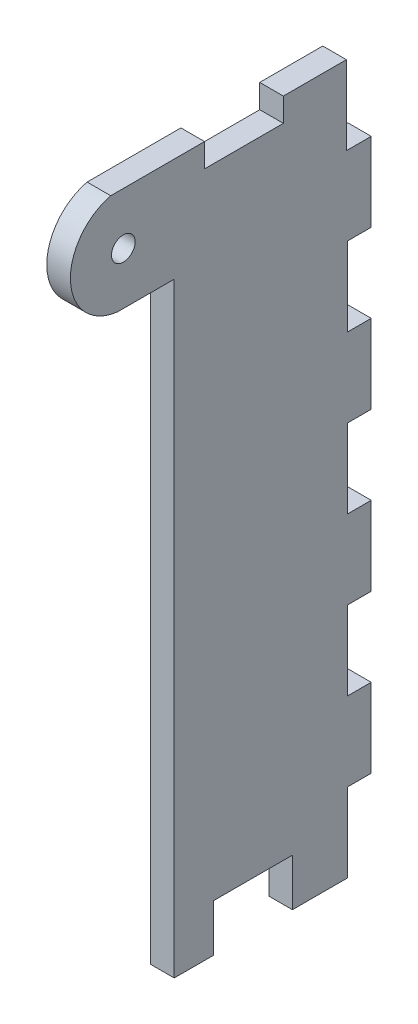
ISO-10303-21;
HEADER;
FILE_DESCRIPTION(('STEP AP214'),'2;1');
FILE_NAME('part.step','',(''),(''),'','','');
FILE_SCHEMA(('AUTOMOTIVE_DESIGN { 1 0 10303 214 1 1 1 1 }'));
ENDSEC;
DATA;
#1=APPLICATION_CONTEXT('core data for automotive mechanical design processes');
#2=APPLICATION_PROTOCOL_DEFINITION('international standard','automotive_design',2000,#1);
#3=PRODUCT_CONTEXT('',#1,'mechanical');
#4=PRODUCT('Part','Part','',(#3));
#5=PRODUCT_RELATED_PRODUCT_CATEGORY('part','',(#4));
#6=PRODUCT_DEFINITION_FORMATION('','',#4);
#7=PRODUCT_DEFINITION_CONTEXT('part definition',#1,'design');
#8=PRODUCT_DEFINITION('design','',#6,#7);
#9=PRODUCT_DEFINITION_SHAPE('','',#8);
#10=(LENGTH_UNIT() NAMED_UNIT(*) SI_UNIT(.MILLI.,.METRE.));
#11=(NAMED_UNIT(*) PLANE_ANGLE_UNIT() SI_UNIT($,.RADIAN.));
#12=(NAMED_UNIT(*) SI_UNIT($,.STERADIAN.) SOLID_ANGLE_UNIT());
#13=UNCERTAINTY_MEASURE_WITH_UNIT(LENGTH_MEASURE(1.E-05),#10,'distance_accuracy_value','');
#14=(GEOMETRIC_REPRESENTATION_CONTEXT(3) GLOBAL_UNCERTAINTY_ASSIGNED_CONTEXT((#13)) GLOBAL_UNIT_ASSIGNED_CONTEXT((#10,
#11,#12)) REPRESENTATION_CONTEXT('',''));
#15=CARTESIAN_POINT('',(0.,0.,0.));
#16=DIRECTION('',(0.,0.,1.));
#17=DIRECTION('',(1.,0.,0.));
#18=AXIS2_PLACEMENT_3D('',#15,#16,#17);
#19=CARTESIAN_POINT('',(3.,89.1714822270664,7.78017889808236));
#20=DIRECTION('',(1.,0.,0.));
#21=DIRECTION('',(0.,0.,-1.));
#22=AXIS2_PLACEMENT_3D('',#19,#20,#21);
#23=PLANE('',#22);
#24=DIRECTION('',(0.,-1.,0.));
#25=VECTOR('',#24,1.);
#26=CARTESIAN_POINT('',(3.,5.69298590310573,1.32442224705042));
#27=LINE('',#26,#25);
#28=CARTESIAN_POINT('',(3.,82.4929859031057,1.32442224705043));
#29=VERTEX_POINT('',#28);
#30=CARTESIAN_POINT('',(3.,5.69298590310573,1.32442224705042));
#31=VERTEX_POINT('',#30);
#32=EDGE_CURVE('E320',#29,#31,#27,.T.);
#33=ORIENTED_EDGE('',*,*,#32,.T.);
#34=DIRECTION('',(0.,0.,-1.));
#35=VECTOR('',#34,1.);
#36=CARTESIAN_POINT('',(3.,5.69298590310573,1.32442224705042));
#37=LINE('',#36,#35);
#38=CARTESIAN_POINT('',(3.,5.69298590310573,-3.67557775294958));
#39=VERTEX_POINT('',#38);
#40=EDGE_CURVE('E158',#31,#39,#37,.T.);
#41=ORIENTED_EDGE('',*,*,#40,.T.);
#42=DIRECTION('',(0.,1.,0.));
#43=VECTOR('',#42,1.);
#44=CARTESIAN_POINT('',(3.,11.6929859031057,-3.67557775294957));
#45=LINE('',#44,#43);
#46=CARTESIAN_POINT('',(3.,11.6929859031057,-3.67557775294957));
#47=VERTEX_POINT('',#46);
#48=EDGE_CURVE('E401',#39,#47,#45,.T.);
#49=ORIENTED_EDGE('',*,*,#48,.T.);
#50=DIRECTION('',(0.,0.,-1.));
#51=VECTOR('',#50,1.);
#52=CARTESIAN_POINT('',(3.,11.6929859031057,-3.67557775294957));
#53=LINE('',#52,#51);
#54=CARTESIAN_POINT('',(3.,11.6929859031057,-13.6755777529496));
#55=VERTEX_POINT('',#54);
#56=EDGE_CURVE('E420',#47,#55,#53,.T.);
#57=ORIENTED_EDGE('',*,*,#56,.T.);
#58=DIRECTION('',(0.,-1.,0.));
#59=VECTOR('',#58,1.);
#60=CARTESIAN_POINT('',(3.,11.6929859031057,-13.6755777529496));
#61=LINE('',#60,#59);
#62=CARTESIAN_POINT('',(3.,5.69298590310573,-13.6755777529496));
#63=VERTEX_POINT('',#62);
#64=EDGE_CURVE('E417',#55,#63,#61,.T.);
#65=ORIENTED_EDGE('',*,*,#64,.T.);
#66=DIRECTION('',(0.,0.,-1.));
#67=VECTOR('',#66,1.);
#68=CARTESIAN_POINT('',(3.,5.69298590310573,-13.6755777529496));
#69=LINE('',#68,#67);
#70=CARTESIAN_POINT('',(3.,5.69298590310573,-20.6755777529496));
#71=VERTEX_POINT('',#70);
#72=EDGE_CURVE('E419',#63,#71,#69,.T.);
#73=ORIENTED_EDGE('',*,*,#72,.T.);
#74=DIRECTION('',(0.,1.,0.));
#75=VECTOR('',#74,1.);
#76=CARTESIAN_POINT('',(3.,15.6929859031058,-20.6755777529496));
#77=LINE('',#76,#75);
#78=CARTESIAN_POINT('',(3.,15.6929859031058,-20.6755777529496));
#79=VERTEX_POINT('',#78);
#80=EDGE_CURVE('E422',#71,#79,#77,.T.);
#81=ORIENTED_EDGE('',*,*,#80,.T.);
#82=DIRECTION('',(0.,0.,-1.));
#83=VECTOR('',#82,1.);
#84=CARTESIAN_POINT('',(3.,15.6929859031058,-20.6755777529496));
#85=LINE('',#84,#83);
#86=CARTESIAN_POINT('',(3.,15.6929859031058,-23.6755777529496));
#87=VERTEX_POINT('',#86);
#88=EDGE_CURVE('E428',#79,#87,#85,.T.);
#89=ORIENTED_EDGE('',*,*,#88,.T.);
#90=DIRECTION('',(0.,1.,0.));
#91=VECTOR('',#90,1.);
#92=CARTESIAN_POINT('',(3.,15.6929859031058,-23.6755777529496));
#93=LINE('',#92,#91);
#94=CARTESIAN_POINT('',(3.,25.6929859031057,-23.6755777529496));
#95=VERTEX_POINT('',#94);
#96=EDGE_CURVE('E430',#87,#95,#93,.T.);
#97=ORIENTED_EDGE('',*,*,#96,.T.);
#98=DIRECTION('',(0.,0.,1.));
#99=VECTOR('',#98,1.);
#100=CARTESIAN_POINT('',(3.,25.6929859031058,-20.6755777529495));
#101=LINE('',#100,#99);
#102=CARTESIAN_POINT('',(3.,25.6929859031058,-20.6755777529495));
#103=VERTEX_POINT('',#102);
#104=EDGE_CURVE('E432',#95,#103,#101,.T.);
#105=ORIENTED_EDGE('',*,*,#104,.T.);
#106=DIRECTION('',(0.,1.,0.));
#107=VECTOR('',#106,1.);
#108=CARTESIAN_POINT('',(3.,35.6929859031058,-20.6755777529495));
#109=LINE('',#108,#107);
#110=CARTESIAN_POINT('',(3.,35.6929859031058,-20.6755777529495));
#111=VERTEX_POINT('',#110);
#112=EDGE_CURVE('E434',#103,#111,#109,.T.);
#113=ORIENTED_EDGE('',*,*,#112,.T.);
#114=DIRECTION('',(0.,0.,-1.));
#115=VECTOR('',#114,1.);
#116=CARTESIAN_POINT('',(3.,35.6929859031058,-20.6755777529495));
#117=LINE('',#116,#115);
#118=CARTESIAN_POINT('',(3.,35.6929859031058,-23.6755777529496));
#119=VERTEX_POINT('',#118);
#120=EDGE_CURVE('E436',#111,#119,#117,.T.);
#121=ORIENTED_EDGE('',*,*,#120,.T.);
#122=DIRECTION('',(0.,1.,0.));
#123=VECTOR('',#122,1.);
#124=CARTESIAN_POINT('',(3.,35.6929859031058,-23.6755777529496));
#125=LINE('',#124,#123);
#126=CARTESIAN_POINT('',(3.,45.6929859031058,-23.6755777529496));
#127=VERTEX_POINT('',#126);
#128=EDGE_CURVE('E438',#119,#127,#125,.T.);
#129=ORIENTED_EDGE('',*,*,#128,.T.);
#130=DIRECTION('',(0.,0.,1.));
#131=VECTOR('',#130,1.);
#132=CARTESIAN_POINT('',(3.,45.6929859031058,-20.6755777529495));
#133=LINE('',#132,#131);
#134=CARTESIAN_POINT('',(3.,45.6929859031058,-20.6755777529495));
#135=VERTEX_POINT('',#134);
#136=EDGE_CURVE('E440',#127,#135,#133,.T.);
#137=ORIENTED_EDGE('',*,*,#136,.T.);
#138=DIRECTION('',(0.,1.,0.));
#139=VECTOR('',#138,1.);
#140=CARTESIAN_POINT('',(3.,55.6929859031058,-20.6755777529495));
#141=LINE('',#140,#139);
#142=CARTESIAN_POINT('',(3.,55.6929859031058,-20.6755777529495));
#143=VERTEX_POINT('',#142);
#144=EDGE_CURVE('E442',#135,#143,#141,.T.);
#145=ORIENTED_EDGE('',*,*,#144,.T.);
#146=DIRECTION('',(0.,0.,-1.));
#147=VECTOR('',#146,1.);
#148=CARTESIAN_POINT('',(3.,55.6929859031058,-20.6755777529495));
#149=LINE('',#148,#147);
#150=CARTESIAN_POINT('',(3.,55.6929859031058,-23.6755777529496));
#151=VERTEX_POINT('',#150);
#152=EDGE_CURVE('E444',#143,#151,#149,.T.);
#153=ORIENTED_EDGE('',*,*,#152,.T.);
#154=DIRECTION('',(0.,1.,0.));
#155=VECTOR('',#154,1.);
#156=CARTESIAN_POINT('',(3.,55.6929859031058,-23.6755777529496));
#157=LINE('',#156,#155);
#158=CARTESIAN_POINT('',(3.,65.6929859031058,-23.6755777529496));
#159=VERTEX_POINT('',#158);
#160=EDGE_CURVE('E446',#151,#159,#157,.T.);
#161=ORIENTED_EDGE('',*,*,#160,.T.);
#162=DIRECTION('',(0.,0.,1.));
#163=VECTOR('',#162,1.);
#164=CARTESIAN_POINT('',(3.,65.6929859031058,-20.6755777529495));
#165=LINE('',#164,#163);
#166=CARTESIAN_POINT('',(3.,65.6929859031058,-20.6755777529495));
#167=VERTEX_POINT('',#166);
#168=EDGE_CURVE('E448',#159,#167,#165,.T.);
#169=ORIENTED_EDGE('',*,*,#168,.T.);
#170=DIRECTION('',(0.,1.,0.));
#171=VECTOR('',#170,1.);
#172=CARTESIAN_POINT('',(3.,75.6929859031058,-20.6755777529495));
#173=LINE('',#172,#171);
#174=CARTESIAN_POINT('',(3.,75.6929859031058,-20.6755777529495));
#175=VERTEX_POINT('',#174);
#176=EDGE_CURVE('E450',#167,#175,#173,.T.);
#177=ORIENTED_EDGE('',*,*,#176,.T.);
#178=DIRECTION('',(0.,0.,-1.));
#179=VECTOR('',#178,1.);
#180=CARTESIAN_POINT('',(3.,75.6929859031058,-20.6755777529495));
#181=LINE('',#180,#179);
#182=CARTESIAN_POINT('',(3.,75.6929859031058,-23.6755777529496));
#183=VERTEX_POINT('',#182);
#184=EDGE_CURVE('E452',#175,#183,#181,.T.);
#185=ORIENTED_EDGE('',*,*,#184,.T.);
#186=DIRECTION('',(0.,1.,0.));
#187=VECTOR('',#186,1.);
#188=CARTESIAN_POINT('',(3.,75.6929859031058,-23.6755777529496));
#189=LINE('',#188,#187);
#190=CARTESIAN_POINT('',(3.,85.6929859031057,-23.6755777529496));
#191=VERTEX_POINT('',#190);
#192=EDGE_CURVE('E454',#183,#191,#189,.T.);
#193=ORIENTED_EDGE('',*,*,#192,.T.);
#194=DIRECTION('',(0.,0.,1.));
#195=VECTOR('',#194,1.);
#196=CARTESIAN_POINT('',(3.,85.6929859031057,-20.525652309048));
#197=LINE('',#196,#195);
#198=CARTESIAN_POINT('',(3.,85.6929859031057,-20.525652309048));
#199=VERTEX_POINT('',#198);
#200=EDGE_CURVE('E456',#191,#199,#197,.T.);
#201=ORIENTED_EDGE('',*,*,#200,.T.);
#202=DIRECTION('',(0.,1.,0.));
#203=VECTOR('',#202,1.);
#204=CARTESIAN_POINT('',(3.,95.6929859031057,-20.525652309048));
#205=LINE('',#204,#203);
#206=CARTESIAN_POINT('',(3.,95.6929859031057,-20.525652309048));
#207=VERTEX_POINT('',#206);
#208=EDGE_CURVE('E458',#199,#207,#205,.T.);
#209=ORIENTED_EDGE('',*,*,#208,.T.);
#210=DIRECTION('',(0.,0.,1.));
#211=VECTOR('',#210,1.);
#212=CARTESIAN_POINT('',(3.,95.6929859031057,-12.525652309048));
#213=LINE('',#212,#211);
#214=CARTESIAN_POINT('',(3.,95.6929859031057,-12.525652309048));
#215=VERTEX_POINT('',#214);
#216=EDGE_CURVE('E460',#207,#215,#213,.T.);
#217=ORIENTED_EDGE('',*,*,#216,.T.);
#218=DIRECTION('',(0.,-1.,0.));
#219=VECTOR('',#218,1.);
#220=CARTESIAN_POINT('',(3.,92.6929859031057,-12.525652309048));
#221=LINE('',#220,#219);
#222=CARTESIAN_POINT('',(3.,92.6929859031057,-12.525652309048));
#223=VERTEX_POINT('',#222);
#224=EDGE_CURVE('E462',#215,#223,#221,.T.);
#225=ORIENTED_EDGE('',*,*,#224,.T.);
#226=DIRECTION('',(0.,0.,1.));
#227=VECTOR('',#226,1.);
#228=CARTESIAN_POINT('',(3.,92.6929859031057,-12.525652309048));
#229=LINE('',#228,#227);
#230=CARTESIAN_POINT('',(3.,92.6929859031057,-2.525652309048));
#231=VERTEX_POINT('',#230);
#232=EDGE_CURVE('E464',#223,#231,#229,.T.);
#233=ORIENTED_EDGE('',*,*,#232,.T.);
#234=DIRECTION('',(0.,1.,0.));
#235=VECTOR('',#234,1.);
#236=CARTESIAN_POINT('',(3.,92.6929859031057,-2.525652309048));
#237=LINE('',#236,#235);
#238=CARTESIAN_POINT('',(3.,95.6929859031057,-2.525652309048));
#239=VERTEX_POINT('',#238);
#240=EDGE_CURVE('E243',#231,#239,#237,.T.);
#241=ORIENTED_EDGE('',*,*,#240,.T.);
#242=DIRECTION('',(0.,0.,1.));
#243=VECTOR('',#242,1.);
#244=CARTESIAN_POINT('',(3.,95.6929859031057,1.0641849902625));
#245=LINE('',#244,#243);
#246=CARTESIAN_POINT('',(3.,95.6929859031057,9.38169605010339));
#247=VERTEX_POINT('',#246);
#248=EDGE_CURVE('E237',#239,#247,#245,.T.);
#249=ORIENTED_EDGE('',*,*,#248,.T.);
#250=CARTESIAN_POINT('',(3.,89.1714822270664,7.78017889808236));
#251=DIRECTION('',(1.,0.,0.));
#252=DIRECTION('',(0.,0.,-1.));
#253=AXIS2_PLACEMENT_3D('',#250,#251,#252);
#254=CIRCLE('',#253,6.71527120709298);
#255=CARTESIAN_POINT('',(3.,82.4929859031057,8.48200098070441));
#256=VERTEX_POINT('',#255);
#257=EDGE_CURVE('E241',#247,#256,#254,.T.);
#258=ORIENTED_EDGE('',*,*,#257,.T.);
#259=DIRECTION('',(0.,0.,-1.));
#260=VECTOR('',#259,1.);
#261=CARTESIAN_POINT('',(3.,82.4929859031057,1.32442224705043));
#262=LINE('',#261,#260);
#263=EDGE_CURVE('E49',#256,#29,#262,.T.);
#264=ORIENTED_EDGE('',*,*,#263,.T.);
#265=EDGE_LOOP('',(#33,#41,#49,#57,#65,#73,#81,#89,#97,#105,#113,#121,#129,#137,#145,#153,#161,
#169,#177,#185,#193,#201,#209,#217,#225,#233,#241,#249,#258,#264));
#266=FACE_BOUND('',#265,.T.);
#267=CARTESIAN_POINT('',(3.,89.0929859031057,7.78355438409246));
#268=DIRECTION('',(1.,0.,0.));
#269=DIRECTION('',(0.,0.,-1.));
#270=AXIS2_PLACEMENT_3D('',#267,#268,#269);
#271=CIRCLE('',#270,1.5);
#272=CARTESIAN_POINT('',(3.,89.0929859031057,6.28355438409246));
#273=VERTEX_POINT('',#272);
#274=EDGE_CURVE('E264',#273,#273,#271,.T.);
#275=ORIENTED_EDGE('',*,*,#274,.F.);
#276=EDGE_LOOP('',(#275));
#277=FACE_BOUND('',#276,.T.);
#278=ADVANCED_FACE('F32',(#266,#277),#23,.T.);
#279=CARTESIAN_POINT('',(0.,89.1714822270664,7.78017889808236));
#280=DIRECTION('',(1.,0.,0.));
#281=DIRECTION('',(0.,0.,-1.));
#282=AXIS2_PLACEMENT_3D('',#279,#280,#281);
#283=PLANE('',#282);
#284=DIRECTION('',(0.,-1.,0.));
#285=VECTOR('',#284,1.);
#286=CARTESIAN_POINT('',(0.,5.69298590310573,1.32442224705042));
#287=LINE('',#286,#285);
#288=CARTESIAN_POINT('',(0.,82.4929859031057,1.32442224705043));
#289=VERTEX_POINT('',#288);
#290=CARTESIAN_POINT('',(0.,5.69298590310573,1.32442224705042));
#291=VERTEX_POINT('',#290);
#292=EDGE_CURVE('E260',#289,#291,#287,.T.);
#293=ORIENTED_EDGE('',*,*,#292,.F.);
#294=DIRECTION('',(0.,0.,-1.));
#295=VECTOR('',#294,1.);
#296=CARTESIAN_POINT('',(0.,82.4929859031057,1.32442224705043));
#297=LINE('',#296,#295);
#298=CARTESIAN_POINT('',(0.,82.4929859031057,8.48200098070441));
#299=VERTEX_POINT('',#298);
#300=EDGE_CURVE('E150',#299,#289,#297,.T.);
#301=ORIENTED_EDGE('',*,*,#300,.F.);
#302=CARTESIAN_POINT('',(0.,89.1714822270664,7.78017889808236));
#303=DIRECTION('',(1.,0.,0.));
#304=DIRECTION('',(0.,0.,-1.));
#305=AXIS2_PLACEMENT_3D('',#302,#303,#304);
#306=CIRCLE('',#305,6.71527120709298);
#307=CARTESIAN_POINT('',(0.,95.6929859031057,9.38169605010339));
#308=VERTEX_POINT('',#307);
#309=EDGE_CURVE('E144',#308,#299,#306,.T.);
#310=ORIENTED_EDGE('',*,*,#309,.F.);
#311=DIRECTION('',(0.,0.,1.));
#312=VECTOR('',#311,1.);
#313=CARTESIAN_POINT('',(0.,95.6929859031057,9.38169605010339));
#314=LINE('',#313,#312);
#315=CARTESIAN_POINT('',(0.,95.6929859031057,-2.525652309048));
#316=VERTEX_POINT('',#315);
#317=EDGE_CURVE('E250',#316,#308,#314,.T.);
#318=ORIENTED_EDGE('',*,*,#317,.F.);
#319=DIRECTION('',(0.,1.,0.));
#320=VECTOR('',#319,1.);
#321=CARTESIAN_POINT('',(0.,92.6929859031057,-2.525652309048));
#322=LINE('',#321,#320);
#323=CARTESIAN_POINT('',(0.,92.6929859031057,-2.525652309048));
#324=VERTEX_POINT('',#323);
#325=EDGE_CURVE('E314',#324,#316,#322,.T.);
#326=ORIENTED_EDGE('',*,*,#325,.F.);
#327=DIRECTION('',(0.,0.,1.));
#328=VECTOR('',#327,1.);
#329=CARTESIAN_POINT('',(0.,92.6929859031057,-12.525652309048));
#330=LINE('',#329,#328);
#331=CARTESIAN_POINT('',(0.,92.6929859031057,-12.525652309048));
#332=VERTEX_POINT('',#331);
#333=EDGE_CURVE('E312',#332,#324,#330,.T.);
#334=ORIENTED_EDGE('',*,*,#333,.F.);
#335=DIRECTION('',(0.,-1.,0.));
#336=VECTOR('',#335,1.);
#337=CARTESIAN_POINT('',(0.,92.6929859031057,-12.525652309048));
#338=LINE('',#337,#336);
#339=CARTESIAN_POINT('',(0.,95.6929859031057,-12.525652309048));
#340=VERTEX_POINT('',#339);
#341=EDGE_CURVE('E310',#340,#332,#338,.T.);
#342=ORIENTED_EDGE('',*,*,#341,.F.);
#343=DIRECTION('',(0.,0.,1.));
#344=VECTOR('',#343,1.);
#345=CARTESIAN_POINT('',(0.,95.6929859031057,-12.525652309048));
#346=LINE('',#345,#344);
#347=CARTESIAN_POINT('',(0.,95.6929859031057,-20.525652309048));
#348=VERTEX_POINT('',#347);
#349=EDGE_CURVE('E308',#348,#340,#346,.T.);
#350=ORIENTED_EDGE('',*,*,#349,.F.);
#351=DIRECTION('',(0.,1.,0.));
#352=VECTOR('',#351,1.);
#353=CARTESIAN_POINT('',(0.,95.6929859031057,-20.525652309048));
#354=LINE('',#353,#352);
#355=CARTESIAN_POINT('',(0.,85.6929859031057,-20.525652309048));
#356=VERTEX_POINT('',#355);
#357=EDGE_CURVE('E306',#356,#348,#354,.T.);
#358=ORIENTED_EDGE('',*,*,#357,.F.);
#359=DIRECTION('',(0.,0.,1.));
#360=VECTOR('',#359,1.);
#361=CARTESIAN_POINT('',(0.,85.6929859031057,-20.525652309048));
#362=LINE('',#361,#360);
#363=CARTESIAN_POINT('',(0.,85.6929859031057,-23.6755777529496));
#364=VERTEX_POINT('',#363);
#365=EDGE_CURVE('E304',#364,#356,#362,.T.);
#366=ORIENTED_EDGE('',*,*,#365,.F.);
#367=DIRECTION('',(0.,1.,0.));
#368=VECTOR('',#367,1.);
#369=CARTESIAN_POINT('',(0.,75.6929859031058,-23.6755777529496));
#370=LINE('',#369,#368);
#371=CARTESIAN_POINT('',(0.,75.6929859031058,-23.6755777529496));
#372=VERTEX_POINT('',#371);
#373=EDGE_CURVE('E302',#372,#364,#370,.T.);
#374=ORIENTED_EDGE('',*,*,#373,.F.);
#375=DIRECTION('',(0.,0.,-1.));
#376=VECTOR('',#375,1.);
#377=CARTESIAN_POINT('',(0.,75.6929859031058,-20.6755777529495));
#378=LINE('',#377,#376);
#379=CARTESIAN_POINT('',(0.,75.6929859031058,-20.6755777529495));
#380=VERTEX_POINT('',#379);
#381=EDGE_CURVE('E300',#380,#372,#378,.T.);
#382=ORIENTED_EDGE('',*,*,#381,.F.);
#383=DIRECTION('',(0.,1.,0.));
#384=VECTOR('',#383,1.);
#385=CARTESIAN_POINT('',(0.,75.6929859031058,-20.6755777529495));
#386=LINE('',#385,#384);
#387=CARTESIAN_POINT('',(0.,65.6929859031058,-20.6755777529495));
#388=VERTEX_POINT('',#387);
#389=EDGE_CURVE('E298',#388,#380,#386,.T.);
#390=ORIENTED_EDGE('',*,*,#389,.F.);
#391=DIRECTION('',(0.,0.,1.));
#392=VECTOR('',#391,1.);
#393=CARTESIAN_POINT('',(0.,65.6929859031058,-20.6755777529495));
#394=LINE('',#393,#392);
#395=CARTESIAN_POINT('',(0.,65.6929859031058,-23.6755777529496));
#396=VERTEX_POINT('',#395);
#397=EDGE_CURVE('E296',#396,#388,#394,.T.);
#398=ORIENTED_EDGE('',*,*,#397,.F.);
#399=DIRECTION('',(0.,1.,0.));
#400=VECTOR('',#399,1.);
#401=CARTESIAN_POINT('',(0.,55.6929859031058,-23.6755777529496));
#402=LINE('',#401,#400);
#403=CARTESIAN_POINT('',(0.,55.6929859031058,-23.6755777529496));
#404=VERTEX_POINT('',#403);
#405=EDGE_CURVE('E294',#404,#396,#402,.T.);
#406=ORIENTED_EDGE('',*,*,#405,.F.);
#407=DIRECTION('',(0.,0.,-1.));
#408=VECTOR('',#407,1.);
#409=CARTESIAN_POINT('',(0.,55.6929859031058,-20.6755777529495));
#410=LINE('',#409,#408);
#411=CARTESIAN_POINT('',(0.,55.6929859031058,-20.6755777529495));
#412=VERTEX_POINT('',#411);
#413=EDGE_CURVE('E292',#412,#404,#410,.T.);
#414=ORIENTED_EDGE('',*,*,#413,.F.);
#415=DIRECTION('',(0.,1.,0.));
#416=VECTOR('',#415,1.);
#417=CARTESIAN_POINT('',(0.,55.6929859031058,-20.6755777529495));
#418=LINE('',#417,#416);
#419=CARTESIAN_POINT('',(0.,45.6929859031058,-20.6755777529495));
#420=VERTEX_POINT('',#419);
#421=EDGE_CURVE('E290',#420,#412,#418,.T.);
#422=ORIENTED_EDGE('',*,*,#421,.F.);
#423=DIRECTION('',(0.,0.,1.));
#424=VECTOR('',#423,1.);
#425=CARTESIAN_POINT('',(0.,45.6929859031058,-20.6755777529495));
#426=LINE('',#425,#424);
#427=CARTESIAN_POINT('',(0.,45.6929859031058,-23.6755777529496));
#428=VERTEX_POINT('',#427);
#429=EDGE_CURVE('E288',#428,#420,#426,.T.);
#430=ORIENTED_EDGE('',*,*,#429,.F.);
#431=DIRECTION('',(0.,1.,0.));
#432=VECTOR('',#431,1.);
#433=CARTESIAN_POINT('',(0.,35.6929859031058,-23.6755777529496));
#434=LINE('',#433,#432);
#435=CARTESIAN_POINT('',(0.,35.6929859031058,-23.6755777529496));
#436=VERTEX_POINT('',#435);
#437=EDGE_CURVE('E286',#436,#428,#434,.T.);
#438=ORIENTED_EDGE('',*,*,#437,.F.);
#439=DIRECTION('',(0.,0.,-1.));
#440=VECTOR('',#439,1.);
#441=CARTESIAN_POINT('',(0.,35.6929859031058,-20.6755777529495));
#442=LINE('',#441,#440);
#443=CARTESIAN_POINT('',(0.,35.6929859031058,-20.6755777529495));
#444=VERTEX_POINT('',#443);
#445=EDGE_CURVE('E284',#444,#436,#442,.T.);
#446=ORIENTED_EDGE('',*,*,#445,.F.);
#447=DIRECTION('',(0.,1.,0.));
#448=VECTOR('',#447,1.);
#449=CARTESIAN_POINT('',(0.,35.6929859031058,-20.6755777529495));
#450=LINE('',#449,#448);
#451=CARTESIAN_POINT('',(0.,25.6929859031058,-20.6755777529495));
#452=VERTEX_POINT('',#451);
#453=EDGE_CURVE('E282',#452,#444,#450,.T.);
#454=ORIENTED_EDGE('',*,*,#453,.F.);
#455=DIRECTION('',(0.,0.,1.));
#456=VECTOR('',#455,1.);
#457=CARTESIAN_POINT('',(0.,25.6929859031058,-20.6755777529495));
#458=LINE('',#457,#456);
#459=CARTESIAN_POINT('',(0.,25.6929859031057,-23.6755777529496));
#460=VERTEX_POINT('',#459);
#461=EDGE_CURVE('E280',#460,#452,#458,.T.);
#462=ORIENTED_EDGE('',*,*,#461,.F.);
#463=DIRECTION('',(0.,1.,0.));
#464=VECTOR('',#463,1.);
#465=CARTESIAN_POINT('',(0.,15.6929859031058,-23.6755777529496));
#466=LINE('',#465,#464);
#467=CARTESIAN_POINT('',(0.,15.6929859031058,-23.6755777529496));
#468=VERTEX_POINT('',#467);
#469=EDGE_CURVE('E278',#468,#460,#466,.T.);
#470=ORIENTED_EDGE('',*,*,#469,.F.);
#471=DIRECTION('',(0.,0.,-1.));
#472=VECTOR('',#471,1.);
#473=CARTESIAN_POINT('',(0.,15.6929859031058,-20.6755777529496));
#474=LINE('',#473,#472);
#475=CARTESIAN_POINT('',(0.,15.6929859031058,-20.6755777529496));
#476=VERTEX_POINT('',#475);
#477=EDGE_CURVE('E276',#476,#468,#474,.T.);
#478=ORIENTED_EDGE('',*,*,#477,.F.);
#479=DIRECTION('',(0.,1.,0.));
#480=VECTOR('',#479,1.);
#481=CARTESIAN_POINT('',(0.,15.6929859031058,-20.6755777529496));
#482=LINE('',#481,#480);
#483=CARTESIAN_POINT('',(0.,5.69298590310573,-20.6755777529496));
#484=VERTEX_POINT('',#483);
#485=EDGE_CURVE('E274',#484,#476,#482,.T.);
#486=ORIENTED_EDGE('',*,*,#485,.F.);
#487=DIRECTION('',(0.,0.,-1.));
#488=VECTOR('',#487,1.);
#489=CARTESIAN_POINT('',(0.,5.69298590310573,-13.6755777529496));
#490=LINE('',#489,#488);
#491=CARTESIAN_POINT('',(0.,5.69298590310573,-13.6755777529496));
#492=VERTEX_POINT('',#491);
#493=EDGE_CURVE('E272',#492,#484,#490,.T.);
#494=ORIENTED_EDGE('',*,*,#493,.F.);
#495=DIRECTION('',(0.,-1.,0.));
#496=VECTOR('',#495,1.);
#497=CARTESIAN_POINT('',(0.,11.6929859031057,-13.6755777529496));
#498=LINE('',#497,#496);
#499=CARTESIAN_POINT('',(0.,11.6929859031057,-13.6755777529496));
#500=VERTEX_POINT('',#499);
#501=EDGE_CURVE('E270',#500,#492,#498,.T.);
#502=ORIENTED_EDGE('',*,*,#501,.F.);
#503=DIRECTION('',(0.,0.,-1.));
#504=VECTOR('',#503,1.);
#505=CARTESIAN_POINT('',(0.,11.6929859031057,-3.67557775294957));
#506=LINE('',#505,#504);
#507=CARTESIAN_POINT('',(0.,11.6929859031057,-3.67557775294957));
#508=VERTEX_POINT('',#507);
#509=EDGE_CURVE('E268',#508,#500,#506,.T.);
#510=ORIENTED_EDGE('',*,*,#509,.F.);
#511=DIRECTION('',(0.,1.,0.));
#512=VECTOR('',#511,1.);
#513=CARTESIAN_POINT('',(0.,11.6929859031057,-3.67557775294957));
#514=LINE('',#513,#512);
#515=CARTESIAN_POINT('',(0.,5.69298590310573,-3.67557775294958));
#516=VERTEX_POINT('',#515);
#517=EDGE_CURVE('E266',#516,#508,#514,.T.);
#518=ORIENTED_EDGE('',*,*,#517,.F.);
#519=DIRECTION('',(0.,0.,-1.));
#520=VECTOR('',#519,1.);
#521=CARTESIAN_POINT('',(0.,5.69298590310573,1.32442224705042));
#522=LINE('',#521,#520);
#523=EDGE_CURVE('E263',#291,#516,#522,.T.);
#524=ORIENTED_EDGE('',*,*,#523,.F.);
#525=EDGE_LOOP('',(#293,#301,#310,#318,#326,#334,#342,#350,#358,#366,#374,#382,#390,#398,#406,
#414,#422,#430,#438,#446,#454,#462,#470,#478,#486,#494,#502,#510,#518,#524));
#526=FACE_BOUND('',#525,.T.);
#527=CARTESIAN_POINT('',(0.,89.0929859031057,7.78355438409246));
#528=DIRECTION('',(1.,0.,0.));
#529=DIRECTION('',(0.,0.,-1.));
#530=AXIS2_PLACEMENT_3D('',#527,#528,#529);
#531=CIRCLE('',#530,1.5);
#532=CARTESIAN_POINT('',(0.,89.0929859031057,6.28355438409246));
#533=VERTEX_POINT('',#532);
#534=EDGE_CURVE('E848',#533,#533,#531,.T.);
#535=ORIENTED_EDGE('',*,*,#534,.T.);
#536=EDGE_LOOP('',(#535));
#537=FACE_BOUND('',#536,.T.);
#538=ADVANCED_FACE('F405',(#526,#537),#283,.F.);
#539=CARTESIAN_POINT('',(3.,5.69298590310573,1.32442224705042));
#540=DIRECTION('',(0.,0.,-1.));
#541=DIRECTION('',(0.,1.,0.));
#542=AXIS2_PLACEMENT_3D('',#539,#540,#541);
#543=PLANE('',#542);
#544=ORIENTED_EDGE('',*,*,#292,.T.);
#545=DIRECTION('',(-1.,0.,0.));
#546=VECTOR('',#545,1.);
#547=CARTESIAN_POINT('',(3.,5.69298590310573,1.32442224705042));
#548=LINE('',#547,#546);
#549=EDGE_CURVE('E11',#31,#291,#548,.T.);
#550=ORIENTED_EDGE('',*,*,#549,.F.);
#551=ORIENTED_EDGE('',*,*,#32,.F.);
#552=DIRECTION('',(-1.,0.,0.));
#553=VECTOR('',#552,1.);
#554=CARTESIAN_POINT('',(3.,82.4929859031057,1.32442224705043));
#555=LINE('',#554,#553);
#556=EDGE_CURVE('E256',#29,#289,#555,.T.);
#557=ORIENTED_EDGE('',*,*,#556,.T.);
#558=EDGE_LOOP('',(#544,#550,#551,#557));
#559=FACE_BOUND('',#558,.T.);
#560=ADVANCED_FACE('F34',(#559),#543,.F.);
#561=CARTESIAN_POINT('',(3.,5.69298590310573,1.32442224705042));
#562=DIRECTION('',(0.,1.,0.));
#563=DIRECTION('',(0.,0.,1.));
#564=AXIS2_PLACEMENT_3D('',#561,#562,#563);
#565=PLANE('',#564);
#566=ORIENTED_EDGE('',*,*,#523,.T.);
#567=DIRECTION('',(-1.,0.,0.));
#568=VECTOR('',#567,1.);
#569=CARTESIAN_POINT('',(3.,5.69298590310573,-3.67557775294958));
#570=LINE('',#569,#568);
#571=EDGE_CURVE('E41',#39,#516,#570,.T.);
#572=ORIENTED_EDGE('',*,*,#571,.F.);
#573=ORIENTED_EDGE('',*,*,#40,.F.);
#574=ORIENTED_EDGE('',*,*,#549,.T.);
#575=EDGE_LOOP('',(#566,#572,#573,#574));
#576=FACE_BOUND('',#575,.T.);
#577=ADVANCED_FACE('F499',(#576),#565,.F.);
#578=CARTESIAN_POINT('',(3.,11.6929859031057,-3.67557775294957));
#579=DIRECTION('',(0.,0.,1.));
#580=DIRECTION('',(0.,-1.,0.));
#581=AXIS2_PLACEMENT_3D('',#578,#579,#580);
#582=PLANE('',#581);
#583=ORIENTED_EDGE('',*,*,#517,.T.);
#584=DIRECTION('',(-1.,0.,0.));
#585=VECTOR('',#584,1.);
#586=CARTESIAN_POINT('',(3.,11.6929859031057,-3.67557775294957));
#587=LINE('',#586,#585);
#588=EDGE_CURVE('E393',#47,#508,#587,.T.);
#589=ORIENTED_EDGE('',*,*,#588,.F.);
#590=ORIENTED_EDGE('',*,*,#48,.F.);
#591=ORIENTED_EDGE('',*,*,#571,.T.);
#592=EDGE_LOOP('',(#583,#589,#590,#591));
#593=FACE_BOUND('',#592,.T.);
#594=ADVANCED_FACE('F399',(#593),#582,.F.);
#595=CARTESIAN_POINT('',(3.,11.6929859031057,-3.67557775294957));
#596=DIRECTION('',(0.,1.,0.));
#597=DIRECTION('',(0.,0.,1.));
#598=AXIS2_PLACEMENT_3D('',#595,#596,#597);
#599=PLANE('',#598);
#600=ORIENTED_EDGE('',*,*,#509,.T.);
#601=DIRECTION('',(-1.,0.,0.));
#602=VECTOR('',#601,1.);
#603=CARTESIAN_POINT('',(3.,11.6929859031057,-13.6755777529496));
#604=LINE('',#603,#602);
#605=EDGE_CURVE('E390',#55,#500,#604,.T.);
#606=ORIENTED_EDGE('',*,*,#605,.F.);
#607=ORIENTED_EDGE('',*,*,#56,.F.);
#608=ORIENTED_EDGE('',*,*,#588,.T.);
#609=EDGE_LOOP('',(#600,#606,#607,#608));
#610=FACE_BOUND('',#609,.T.);
#611=ADVANCED_FACE('F411',(#610),#599,.F.);
#612=CARTESIAN_POINT('',(3.,11.6929859031057,-13.6755777529496));
#613=DIRECTION('',(0.,0.,-1.));
#614=DIRECTION('',(0.,1.,0.));
#615=AXIS2_PLACEMENT_3D('',#612,#613,#614);
#616=PLANE('',#615);
#617=ORIENTED_EDGE('',*,*,#501,.T.);
#618=DIRECTION('',(-1.,0.,0.));
#619=VECTOR('',#618,1.);
#620=CARTESIAN_POINT('',(3.,5.69298590310573,-13.6755777529496));
#621=LINE('',#620,#619);
#622=EDGE_CURVE('E387',#63,#492,#621,.T.);
#623=ORIENTED_EDGE('',*,*,#622,.F.);
#624=ORIENTED_EDGE('',*,*,#64,.F.);
#625=ORIENTED_EDGE('',*,*,#605,.T.);
#626=EDGE_LOOP('',(#617,#623,#624,#625));
#627=FACE_BOUND('',#626,.T.);
#628=ADVANCED_FACE('F415',(#627),#616,.F.);
#629=CARTESIAN_POINT('',(3.,5.69298590310573,-13.6755777529496));
#630=DIRECTION('',(0.,1.,0.));
#631=DIRECTION('',(0.,0.,1.));
#632=AXIS2_PLACEMENT_3D('',#629,#630,#631);
#633=PLANE('',#632);
#634=ORIENTED_EDGE('',*,*,#493,.T.);
#635=DIRECTION('',(-1.,0.,0.));
#636=VECTOR('',#635,1.);
#637=CARTESIAN_POINT('',(3.,5.69298590310573,-20.6755777529496));
#638=LINE('',#637,#636);
#639=EDGE_CURVE('E384',#71,#484,#638,.T.);
#640=ORIENTED_EDGE('',*,*,#639,.F.);
#641=ORIENTED_EDGE('',*,*,#72,.F.);
#642=ORIENTED_EDGE('',*,*,#622,.T.);
#643=EDGE_LOOP('',(#634,#640,#641,#642));
#644=FACE_BOUND('',#643,.T.);
#645=ADVANCED_FACE('F512',(#644),#633,.F.);
#646=CARTESIAN_POINT('',(3.,15.6929859031058,-20.6755777529496));
#647=DIRECTION('',(0.,0.,1.));
#648=DIRECTION('',(0.,-1.,0.));
#649=AXIS2_PLACEMENT_3D('',#646,#647,#648);
#650=PLANE('',#649);
#651=ORIENTED_EDGE('',*,*,#485,.T.);
#652=DIRECTION('',(-1.,0.,0.));
#653=VECTOR('',#652,1.);
#654=CARTESIAN_POINT('',(3.,15.6929859031058,-20.6755777529496));
#655=LINE('',#654,#653);
#656=EDGE_CURVE('E381',#79,#476,#655,.T.);
#657=ORIENTED_EDGE('',*,*,#656,.F.);
#658=ORIENTED_EDGE('',*,*,#80,.F.);
#659=ORIENTED_EDGE('',*,*,#639,.T.);
#660=EDGE_LOOP('',(#651,#657,#658,#659));
#661=FACE_BOUND('',#660,.T.);
#662=ADVANCED_FACE('F515',(#661),#650,.F.);
#663=CARTESIAN_POINT('',(3.,15.6929859031058,-20.6755777529496));
#664=DIRECTION('',(0.,1.,0.));
#665=DIRECTION('',(0.,0.,1.));
#666=AXIS2_PLACEMENT_3D('',#663,#664,#665);
#667=PLANE('',#666);
#668=ORIENTED_EDGE('',*,*,#477,.T.);
#669=DIRECTION('',(-1.,0.,0.));
#670=VECTOR('',#669,1.);
#671=CARTESIAN_POINT('',(3.,15.6929859031058,-23.6755777529496));
#672=LINE('',#671,#670);
#673=EDGE_CURVE('E378',#87,#468,#672,.T.);
#674=ORIENTED_EDGE('',*,*,#673,.F.);
#675=ORIENTED_EDGE('',*,*,#88,.F.);
#676=ORIENTED_EDGE('',*,*,#656,.T.);
#677=EDGE_LOOP('',(#668,#674,#675,#676));
#678=FACE_BOUND('',#677,.T.);
#679=ADVANCED_FACE('F519',(#678),#667,.F.);
#680=CARTESIAN_POINT('',(3.,15.6929859031058,-23.6755777529496));
#681=DIRECTION('',(0.,0.,1.));
#682=DIRECTION('',(1.,0.,0.));
#683=AXIS2_PLACEMENT_3D('',#680,#681,#682);
#684=PLANE('',#683);
#685=ORIENTED_EDGE('',*,*,#469,.T.);
#686=DIRECTION('',(-1.,0.,0.));
#687=VECTOR('',#686,1.);
#688=CARTESIAN_POINT('',(3.,25.6929859031057,-23.6755777529496));
#689=LINE('',#688,#687);
#690=EDGE_CURVE('E375',#95,#460,#689,.T.);
#691=ORIENTED_EDGE('',*,*,#690,.F.);
#692=ORIENTED_EDGE('',*,*,#96,.F.);
#693=ORIENTED_EDGE('',*,*,#673,.T.);
#694=EDGE_LOOP('',(#685,#691,#692,#693));
#695=FACE_BOUND('',#694,.T.);
#696=ADVANCED_FACE('F523',(#695),#684,.F.);
#697=CARTESIAN_POINT('',(3.,25.6929859031058,-20.6755777529495));
#698=DIRECTION('',(0.,-1.,0.));
#699=DIRECTION('',(0.,0.,-1.));
#700=AXIS2_PLACEMENT_3D('',#697,#698,#699);
#701=PLANE('',#700);
#702=ORIENTED_EDGE('',*,*,#461,.T.);
#703=DIRECTION('',(-1.,0.,0.));
#704=VECTOR('',#703,1.);
#705=CARTESIAN_POINT('',(3.,25.6929859031058,-20.6755777529495));
#706=LINE('',#705,#704);
#707=EDGE_CURVE('E372',#103,#452,#706,.T.);
#708=ORIENTED_EDGE('',*,*,#707,.F.);
#709=ORIENTED_EDGE('',*,*,#104,.F.);
#710=ORIENTED_EDGE('',*,*,#690,.T.);
#711=EDGE_LOOP('',(#702,#708,#709,#710));
#712=FACE_BOUND('',#711,.T.);
#713=ADVANCED_FACE('F527',(#712),#701,.F.);
#714=CARTESIAN_POINT('',(3.,35.6929859031058,-20.6755777529495));
#715=DIRECTION('',(0.,0.,1.));
#716=DIRECTION('',(0.,-1.,0.));
#717=AXIS2_PLACEMENT_3D('',#714,#715,#716);
#718=PLANE('',#717);
#719=ORIENTED_EDGE('',*,*,#453,.T.);
#720=DIRECTION('',(-1.,0.,0.));
#721=VECTOR('',#720,1.);
#722=CARTESIAN_POINT('',(3.,35.6929859031058,-20.6755777529495));
#723=LINE('',#722,#721);
#724=EDGE_CURVE('E369',#111,#444,#723,.T.);
#725=ORIENTED_EDGE('',*,*,#724,.F.);
#726=ORIENTED_EDGE('',*,*,#112,.F.);
#727=ORIENTED_EDGE('',*,*,#707,.T.);
#728=EDGE_LOOP('',(#719,#725,#726,#727));
#729=FACE_BOUND('',#728,.T.);
#730=ADVANCED_FACE('F531',(#729),#718,.F.);
#731=CARTESIAN_POINT('',(3.,35.6929859031058,-20.6755777529495));
#732=DIRECTION('',(0.,1.,0.));
#733=DIRECTION('',(0.,0.,1.));
#734=AXIS2_PLACEMENT_3D('',#731,#732,#733);
#735=PLANE('',#734);
#736=ORIENTED_EDGE('',*,*,#445,.T.);
#737=DIRECTION('',(-1.,0.,0.));
#738=VECTOR('',#737,1.);
#739=CARTESIAN_POINT('',(3.,35.6929859031058,-23.6755777529496));
#740=LINE('',#739,#738);
#741=EDGE_CURVE('E366',#119,#436,#740,.T.);
#742=ORIENTED_EDGE('',*,*,#741,.F.);
#743=ORIENTED_EDGE('',*,*,#120,.F.);
#744=ORIENTED_EDGE('',*,*,#724,.T.);
#745=EDGE_LOOP('',(#736,#742,#743,#744));
#746=FACE_BOUND('',#745,.T.);
#747=ADVANCED_FACE('F535',(#746),#735,.F.);
#748=CARTESIAN_POINT('',(3.,35.6929859031058,-23.6755777529496));
#749=DIRECTION('',(0.,0.,1.));
#750=DIRECTION('',(1.,0.,0.));
#751=AXIS2_PLACEMENT_3D('',#748,#749,#750);
#752=PLANE('',#751);
#753=ORIENTED_EDGE('',*,*,#437,.T.);
#754=DIRECTION('',(-1.,0.,0.));
#755=VECTOR('',#754,1.);
#756=CARTESIAN_POINT('',(3.,45.6929859031058,-23.6755777529496));
#757=LINE('',#756,#755);
#758=EDGE_CURVE('E363',#127,#428,#757,.T.);
#759=ORIENTED_EDGE('',*,*,#758,.F.);
#760=ORIENTED_EDGE('',*,*,#128,.F.);
#761=ORIENTED_EDGE('',*,*,#741,.T.);
#762=EDGE_LOOP('',(#753,#759,#760,#761));
#763=FACE_BOUND('',#762,.T.);
#764=ADVANCED_FACE('F539',(#763),#752,.F.);
#765=CARTESIAN_POINT('',(3.,45.6929859031058,-20.6755777529495));
#766=DIRECTION('',(0.,-1.,0.));
#767=DIRECTION('',(0.,0.,-1.));
#768=AXIS2_PLACEMENT_3D('',#765,#766,#767);
#769=PLANE('',#768);
#770=ORIENTED_EDGE('',*,*,#429,.T.);
#771=DIRECTION('',(-1.,0.,0.));
#772=VECTOR('',#771,1.);
#773=CARTESIAN_POINT('',(3.,45.6929859031058,-20.6755777529495));
#774=LINE('',#773,#772);
#775=EDGE_CURVE('E360',#135,#420,#774,.T.);
#776=ORIENTED_EDGE('',*,*,#775,.F.);
#777=ORIENTED_EDGE('',*,*,#136,.F.);
#778=ORIENTED_EDGE('',*,*,#758,.T.);
#779=EDGE_LOOP('',(#770,#776,#777,#778));
#780=FACE_BOUND('',#779,.T.);
#781=ADVANCED_FACE('F543',(#780),#769,.F.);
#782=CARTESIAN_POINT('',(3.,55.6929859031058,-20.6755777529495));
#783=DIRECTION('',(0.,0.,1.));
#784=DIRECTION('',(0.,-1.,0.));
#785=AXIS2_PLACEMENT_3D('',#782,#783,#784);
#786=PLANE('',#785);
#787=ORIENTED_EDGE('',*,*,#421,.T.);
#788=DIRECTION('',(-1.,0.,0.));
#789=VECTOR('',#788,1.);
#790=CARTESIAN_POINT('',(3.,55.6929859031058,-20.6755777529495));
#791=LINE('',#790,#789);
#792=EDGE_CURVE('E357',#143,#412,#791,.T.);
#793=ORIENTED_EDGE('',*,*,#792,.F.);
#794=ORIENTED_EDGE('',*,*,#144,.F.);
#795=ORIENTED_EDGE('',*,*,#775,.T.);
#796=EDGE_LOOP('',(#787,#793,#794,#795));
#797=FACE_BOUND('',#796,.T.);
#798=ADVANCED_FACE('F547',(#797),#786,.F.);
#799=CARTESIAN_POINT('',(3.,55.6929859031058,-20.6755777529495));
#800=DIRECTION('',(0.,1.,0.));
#801=DIRECTION('',(0.,0.,1.));
#802=AXIS2_PLACEMENT_3D('',#799,#800,#801);
#803=PLANE('',#802);
#804=ORIENTED_EDGE('',*,*,#413,.T.);
#805=DIRECTION('',(-1.,0.,0.));
#806=VECTOR('',#805,1.);
#807=CARTESIAN_POINT('',(3.,55.6929859031058,-23.6755777529496));
#808=LINE('',#807,#806);
#809=EDGE_CURVE('E354',#151,#404,#808,.T.);
#810=ORIENTED_EDGE('',*,*,#809,.F.);
#811=ORIENTED_EDGE('',*,*,#152,.F.);
#812=ORIENTED_EDGE('',*,*,#792,.T.);
#813=EDGE_LOOP('',(#804,#810,#811,#812));
#814=FACE_BOUND('',#813,.T.);
#815=ADVANCED_FACE('F551',(#814),#803,.F.);
#816=CARTESIAN_POINT('',(3.,55.6929859031058,-23.6755777529496));
#817=DIRECTION('',(0.,0.,1.));
#818=DIRECTION('',(1.,0.,0.));
#819=AXIS2_PLACEMENT_3D('',#816,#817,#818);
#820=PLANE('',#819);
#821=ORIENTED_EDGE('',*,*,#405,.T.);
#822=DIRECTION('',(-1.,0.,0.));
#823=VECTOR('',#822,1.);
#824=CARTESIAN_POINT('',(3.,65.6929859031058,-23.6755777529496));
#825=LINE('',#824,#823);
#826=EDGE_CURVE('E351',#159,#396,#825,.T.);
#827=ORIENTED_EDGE('',*,*,#826,.F.);
#828=ORIENTED_EDGE('',*,*,#160,.F.);
#829=ORIENTED_EDGE('',*,*,#809,.T.);
#830=EDGE_LOOP('',(#821,#827,#828,#829));
#831=FACE_BOUND('',#830,.T.);
#832=ADVANCED_FACE('F555',(#831),#820,.F.);
#833=CARTESIAN_POINT('',(3.,65.6929859031058,-20.6755777529495));
#834=DIRECTION('',(0.,-1.,0.));
#835=DIRECTION('',(0.,0.,-1.));
#836=AXIS2_PLACEMENT_3D('',#833,#834,#835);
#837=PLANE('',#836);
#838=ORIENTED_EDGE('',*,*,#397,.T.);
#839=DIRECTION('',(-1.,0.,0.));
#840=VECTOR('',#839,1.);
#841=CARTESIAN_POINT('',(3.,65.6929859031058,-20.6755777529495));
#842=LINE('',#841,#840);
#843=EDGE_CURVE('E348',#167,#388,#842,.T.);
#844=ORIENTED_EDGE('',*,*,#843,.F.);
#845=ORIENTED_EDGE('',*,*,#168,.F.);
#846=ORIENTED_EDGE('',*,*,#826,.T.);
#847=EDGE_LOOP('',(#838,#844,#845,#846));
#848=FACE_BOUND('',#847,.T.);
#849=ADVANCED_FACE('F559',(#848),#837,.F.);
#850=CARTESIAN_POINT('',(3.,75.6929859031058,-20.6755777529495));
#851=DIRECTION('',(0.,0.,1.));
#852=DIRECTION('',(0.,-1.,0.));
#853=AXIS2_PLACEMENT_3D('',#850,#851,#852);
#854=PLANE('',#853);
#855=ORIENTED_EDGE('',*,*,#389,.T.);
#856=DIRECTION('',(-1.,0.,0.));
#857=VECTOR('',#856,1.);
#858=CARTESIAN_POINT('',(3.,75.6929859031058,-20.6755777529495));
#859=LINE('',#858,#857);
#860=EDGE_CURVE('E345',#175,#380,#859,.T.);
#861=ORIENTED_EDGE('',*,*,#860,.F.);
#862=ORIENTED_EDGE('',*,*,#176,.F.);
#863=ORIENTED_EDGE('',*,*,#843,.T.);
#864=EDGE_LOOP('',(#855,#861,#862,#863));
#865=FACE_BOUND('',#864,.T.);
#866=ADVANCED_FACE('F563',(#865),#854,.F.);
#867=CARTESIAN_POINT('',(3.,75.6929859031058,-20.6755777529495));
#868=DIRECTION('',(0.,1.,0.));
#869=DIRECTION('',(0.,0.,1.));
#870=AXIS2_PLACEMENT_3D('',#867,#868,#869);
#871=PLANE('',#870);
#872=ORIENTED_EDGE('',*,*,#381,.T.);
#873=DIRECTION('',(-1.,0.,0.));
#874=VECTOR('',#873,1.);
#875=CARTESIAN_POINT('',(3.,75.6929859031058,-23.6755777529496));
#876=LINE('',#875,#874);
#877=EDGE_CURVE('E342',#183,#372,#876,.T.);
#878=ORIENTED_EDGE('',*,*,#877,.F.);
#879=ORIENTED_EDGE('',*,*,#184,.F.);
#880=ORIENTED_EDGE('',*,*,#860,.T.);
#881=EDGE_LOOP('',(#872,#878,#879,#880));
#882=FACE_BOUND('',#881,.T.);
#883=ADVANCED_FACE('F567',(#882),#871,.F.);
#884=CARTESIAN_POINT('',(3.,75.6929859031058,-23.6755777529496));
#885=DIRECTION('',(0.,0.,1.));
#886=DIRECTION('',(1.,0.,0.));
#887=AXIS2_PLACEMENT_3D('',#884,#885,#886);
#888=PLANE('',#887);
#889=ORIENTED_EDGE('',*,*,#373,.T.);
#890=DIRECTION('',(-1.,0.,0.));
#891=VECTOR('',#890,1.);
#892=CARTESIAN_POINT('',(3.,85.6929859031057,-23.6755777529496));
#893=LINE('',#892,#891);
#894=EDGE_CURVE('E339',#191,#364,#893,.T.);
#895=ORIENTED_EDGE('',*,*,#894,.F.);
#896=ORIENTED_EDGE('',*,*,#192,.F.);
#897=ORIENTED_EDGE('',*,*,#877,.T.);
#898=EDGE_LOOP('',(#889,#895,#896,#897));
#899=FACE_BOUND('',#898,.T.);
#900=ADVANCED_FACE('F571',(#899),#888,.F.);
#901=CARTESIAN_POINT('',(3.,85.6929859031057,-20.525652309048));
#902=DIRECTION('',(0.,-1.,0.));
#903=DIRECTION('',(0.,0.,-1.));
#904=AXIS2_PLACEMENT_3D('',#901,#902,#903);
#905=PLANE('',#904);
#906=ORIENTED_EDGE('',*,*,#365,.T.);
#907=DIRECTION('',(-1.,0.,0.));
#908=VECTOR('',#907,1.);
#909=CARTESIAN_POINT('',(3.,85.6929859031057,-20.525652309048));
#910=LINE('',#909,#908);
#911=EDGE_CURVE('E336',#199,#356,#910,.T.);
#912=ORIENTED_EDGE('',*,*,#911,.F.);
#913=ORIENTED_EDGE('',*,*,#200,.F.);
#914=ORIENTED_EDGE('',*,*,#894,.T.);
#915=EDGE_LOOP('',(#906,#912,#913,#914));
#916=FACE_BOUND('',#915,.T.);
#917=ADVANCED_FACE('F575',(#916),#905,.F.);
#918=CARTESIAN_POINT('',(3.,95.6929859031057,-20.525652309048));
#919=DIRECTION('',(0.,0.,1.));
#920=DIRECTION('',(1.,0.,0.));
#921=AXIS2_PLACEMENT_3D('',#918,#919,#920);
#922=PLANE('',#921);
#923=ORIENTED_EDGE('',*,*,#357,.T.);
#924=DIRECTION('',(-1.,0.,0.));
#925=VECTOR('',#924,1.);
#926=CARTESIAN_POINT('',(3.,95.6929859031057,-20.525652309048));
#927=LINE('',#926,#925);
#928=EDGE_CURVE('E333',#207,#348,#927,.T.);
#929=ORIENTED_EDGE('',*,*,#928,.F.);
#930=ORIENTED_EDGE('',*,*,#208,.F.);
#931=ORIENTED_EDGE('',*,*,#911,.T.);
#932=EDGE_LOOP('',(#923,#929,#930,#931));
#933=FACE_BOUND('',#932,.T.);
#934=ADVANCED_FACE('F579',(#933),#922,.F.);
#935=CARTESIAN_POINT('',(3.,95.6929859031057,-12.525652309048));
#936=DIRECTION('',(0.,-1.,0.));
#937=DIRECTION('',(0.,0.,-1.));
#938=AXIS2_PLACEMENT_3D('',#935,#936,#937);
#939=PLANE('',#938);
#940=ORIENTED_EDGE('',*,*,#349,.T.);
#941=DIRECTION('',(-1.,0.,0.));
#942=VECTOR('',#941,1.);
#943=CARTESIAN_POINT('',(3.,95.6929859031057,-12.525652309048));
#944=LINE('',#943,#942);
#945=EDGE_CURVE('E330',#215,#340,#944,.T.);
#946=ORIENTED_EDGE('',*,*,#945,.F.);
#947=ORIENTED_EDGE('',*,*,#216,.F.);
#948=ORIENTED_EDGE('',*,*,#928,.T.);
#949=EDGE_LOOP('',(#940,#946,#947,#948));
#950=FACE_BOUND('',#949,.T.);
#951=ADVANCED_FACE('F583',(#950),#939,.F.);
#952=CARTESIAN_POINT('',(3.,92.6929859031057,-12.525652309048));
#953=DIRECTION('',(0.,0.,-1.));
#954=DIRECTION('',(0.,1.,0.));
#955=AXIS2_PLACEMENT_3D('',#952,#953,#954);
#956=PLANE('',#955);
#957=ORIENTED_EDGE('',*,*,#341,.T.);
#958=DIRECTION('',(-1.,0.,0.));
#959=VECTOR('',#958,1.);
#960=CARTESIAN_POINT('',(3.,92.6929859031057,-12.525652309048));
#961=LINE('',#960,#959);
#962=EDGE_CURVE('E327',#223,#332,#961,.T.);
#963=ORIENTED_EDGE('',*,*,#962,.F.);
#964=ORIENTED_EDGE('',*,*,#224,.F.);
#965=ORIENTED_EDGE('',*,*,#945,.T.);
#966=EDGE_LOOP('',(#957,#963,#964,#965));
#967=FACE_BOUND('',#966,.T.);
#968=ADVANCED_FACE('F587',(#967),#956,.F.);
#969=CARTESIAN_POINT('',(3.,92.6929859031057,-12.525652309048));
#970=DIRECTION('',(0.,-1.,0.));
#971=DIRECTION('',(0.,0.,-1.));
#972=AXIS2_PLACEMENT_3D('',#969,#970,#971);
#973=PLANE('',#972);
#974=ORIENTED_EDGE('',*,*,#333,.T.);
#975=DIRECTION('',(-1.,0.,0.));
#976=VECTOR('',#975,1.);
#977=CARTESIAN_POINT('',(3.,92.6929859031057,-2.525652309048));
#978=LINE('',#977,#976);
#979=EDGE_CURVE('E324',#231,#324,#978,.T.);
#980=ORIENTED_EDGE('',*,*,#979,.F.);
#981=ORIENTED_EDGE('',*,*,#232,.F.);
#982=ORIENTED_EDGE('',*,*,#962,.T.);
#983=EDGE_LOOP('',(#974,#980,#981,#982));
#984=FACE_BOUND('',#983,.T.);
#985=ADVANCED_FACE('F470',(#984),#973,.F.);
#986=CARTESIAN_POINT('',(3.,92.6929859031057,-2.525652309048));
#987=DIRECTION('',(0.,0.,1.));
#988=DIRECTION('',(1.,0.,0.));
#989=AXIS2_PLACEMENT_3D('',#986,#987,#988);
#990=PLANE('',#989);
#991=ORIENTED_EDGE('',*,*,#325,.T.);
#992=DIRECTION('',(-1.,0.,0.));
#993=VECTOR('',#992,1.);
#994=CARTESIAN_POINT('',(3.,95.6929859031057,-2.525652309048));
#995=LINE('',#994,#993);
#996=EDGE_CURVE('E251',#239,#316,#995,.T.);
#997=ORIENTED_EDGE('',*,*,#996,.F.);
#998=ORIENTED_EDGE('',*,*,#240,.F.);
#999=ORIENTED_EDGE('',*,*,#979,.T.);
#1000=EDGE_LOOP('',(#991,#997,#998,#999));
#1001=FACE_BOUND('',#1000,.T.);
#1002=ADVANCED_FACE('F474',(#1001),#990,.F.);
#1003=CARTESIAN_POINT('',(3.,95.6929859031057,9.38169605010339));
#1004=DIRECTION('',(0.,-1.,0.));
#1005=DIRECTION('',(0.,0.,-1.));
#1006=AXIS2_PLACEMENT_3D('',#1003,#1004,#1005);
#1007=PLANE('',#1006);
#1008=ORIENTED_EDGE('',*,*,#317,.T.);
#1009=DIRECTION('',(-1.,0.,0.));
#1010=VECTOR('',#1009,1.);
#1011=CARTESIAN_POINT('',(3.,95.6929859031057,9.38169605010339));
#1012=LINE('',#1011,#1010);
#1013=EDGE_CURVE('E248',#247,#308,#1012,.T.);
#1014=ORIENTED_EDGE('',*,*,#1013,.F.);
#1015=ORIENTED_EDGE('',*,*,#248,.F.);
#1016=ORIENTED_EDGE('',*,*,#996,.T.);
#1017=EDGE_LOOP('',(#1008,#1014,#1015,#1016));
#1018=FACE_BOUND('',#1017,.T.);
#1019=ADVANCED_FACE('F249',(#1018),#1007,.F.);
#1020=CARTESIAN_POINT('',(3.,89.1714822270664,7.78017889808236));
#1021=DIRECTION('',(-1.,0.,0.));
#1022=DIRECTION('',(0.,0.,1.));
#1023=AXIS2_PLACEMENT_3D('',#1020,#1021,#1022);
#1024=CYLINDRICAL_SURFACE('',#1023,6.71527120709298);
#1025=ORIENTED_EDGE('',*,*,#309,.T.);
#1026=DIRECTION('',(-1.,0.,0.));
#1027=VECTOR('',#1026,1.);
#1028=CARTESIAN_POINT('',(3.,82.4929859031057,8.48200098070441));
#1029=LINE('',#1028,#1027);
#1030=EDGE_CURVE('E252',#256,#299,#1029,.T.);
#1031=ORIENTED_EDGE('',*,*,#1030,.F.);
#1032=ORIENTED_EDGE('',*,*,#257,.F.);
#1033=ORIENTED_EDGE('',*,*,#1013,.T.);
#1034=EDGE_LOOP('',(#1025,#1031,#1032,#1033));
#1035=FACE_BOUND('',#1034,.T.);
#1036=ADVANCED_FACE('F254',(#1035),#1024,.T.);
#1037=CARTESIAN_POINT('',(3.,82.4929859031057,1.32442224705043));
#1038=DIRECTION('',(0.,1.,0.));
#1039=DIRECTION('',(0.,0.,1.));
#1040=AXIS2_PLACEMENT_3D('',#1037,#1038,#1039);
#1041=PLANE('',#1040);
#1042=ORIENTED_EDGE('',*,*,#300,.T.);
#1043=ORIENTED_EDGE('',*,*,#556,.F.);
#1044=ORIENTED_EDGE('',*,*,#263,.F.);
#1045=ORIENTED_EDGE('',*,*,#1030,.T.);
#1046=EDGE_LOOP('',(#1042,#1043,#1044,#1045));
#1047=FACE_BOUND('',#1046,.T.);
#1048=ADVANCED_FACE('F479',(#1047),#1041,.F.);
#1049=CARTESIAN_POINT('',(3.,89.0929859031057,7.78355438409246));
#1050=DIRECTION('',(-1.,0.,0.));
#1051=DIRECTION('',(0.,0.,1.));
#1052=AXIS2_PLACEMENT_3D('',#1049,#1050,#1051);
#1053=CYLINDRICAL_SURFACE('',#1052,1.5);
#1054=ORIENTED_EDGE('',*,*,#274,.T.);
#1055=EDGE_LOOP('',(#1054));
#1056=FACE_BOUND('',#1055,.T.);
#1057=ORIENTED_EDGE('',*,*,#534,.F.);
#1058=EDGE_LOOP('',(#1057));
#1059=FACE_BOUND('',#1058,.T.);
#1060=ADVANCED_FACE('F481',(#1056,#1059),#1053,.F.);
#1061=CLOSED_SHELL('',(#278,#538,#560,#577,#594,#611,#628,#645,#662,#679,#696,#713,#730,#747,
#764,#781,#798,#815,#832,#849,#866,#883,#900,#917,#934,#951,#968,#985,#1002,#1019,#1036,#1048,#1060));
#1062=MANIFOLD_SOLID_BREP('B2',#1061);
#1063=ADVANCED_BREP_SHAPE_REPRESENTATION('',(#18,#1062),#14);
#1064=SHAPE_DEFINITION_REPRESENTATION(#9,#1063);
ENDSEC;
END-ISO-10303-21;
